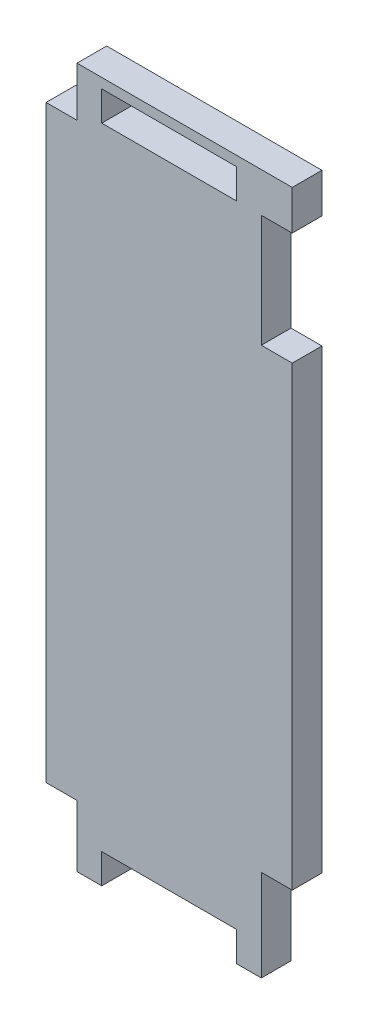
ISO-10303-21;
HEADER;
FILE_DESCRIPTION(('STEP AP214'),'2;1');
FILE_NAME('part.step','',(''),(''),'','','');
FILE_SCHEMA(('AUTOMOTIVE_DESIGN { 1 0 10303 214 1 1 1 1 }'));
ENDSEC;
DATA;
#1=APPLICATION_CONTEXT('core data for automotive mechanical design processes');
#2=APPLICATION_PROTOCOL_DEFINITION('international standard','automotive_design',2000,#1);
#3=PRODUCT_CONTEXT('',#1,'mechanical');
#4=PRODUCT('Part','Part','',(#3));
#5=PRODUCT_RELATED_PRODUCT_CATEGORY('part','',(#4));
#6=PRODUCT_DEFINITION_FORMATION('','',#4);
#7=PRODUCT_DEFINITION_CONTEXT('part definition',#1,'design');
#8=PRODUCT_DEFINITION('design','',#6,#7);
#9=PRODUCT_DEFINITION_SHAPE('','',#8);
#10=(LENGTH_UNIT() NAMED_UNIT(*) SI_UNIT(.MILLI.,.METRE.));
#11=(NAMED_UNIT(*) PLANE_ANGLE_UNIT() SI_UNIT($,.RADIAN.));
#12=(NAMED_UNIT(*) SI_UNIT($,.STERADIAN.) SOLID_ANGLE_UNIT());
#13=UNCERTAINTY_MEASURE_WITH_UNIT(LENGTH_MEASURE(1.E-05),#10,'distance_accuracy_value','');
#14=(GEOMETRIC_REPRESENTATION_CONTEXT(3) GLOBAL_UNCERTAINTY_ASSIGNED_CONTEXT((#13)) GLOBAL_UNIT_ASSIGNED_CONTEXT((#10,
#11,#12)) REPRESENTATION_CONTEXT('',''));
#15=CARTESIAN_POINT('',(0.,0.,0.));
#16=DIRECTION('',(0.,0.,1.));
#17=DIRECTION('',(1.,0.,0.));
#18=AXIS2_PLACEMENT_3D('',#15,#16,#17);
#19=CARTESIAN_POINT('',(-5.71499999999983,0.,3.048));
#20=DIRECTION('',(-1.,0.,0.));
#21=DIRECTION('',(0.,-1.,0.));
#22=AXIS2_PLACEMENT_3D('',#19,#20,#21);
#23=PLANE('',#22);
#24=DIRECTION('',(0.,1.,0.));
#25=VECTOR('',#24,1.);
#26=CARTESIAN_POINT('',(-5.71499999999983,0.,0.));
#27=LINE('',#26,#25);
#28=CARTESIAN_POINT('',(-5.71499999999999,64.77,0.));
#29=VERTEX_POINT('',#28);
#30=CARTESIAN_POINT('',(-5.715,67.818,0.));
#31=VERTEX_POINT('',#30);
#32=EDGE_CURVE('E262',#29,#31,#27,.T.);
#33=ORIENTED_EDGE('',*,*,#32,.F.);
#34=DIRECTION('',(0.,0.,-1.));
#35=VECTOR('',#34,1.);
#36=CARTESIAN_POINT('',(-5.71499999999999,64.77,3.048));
#37=LINE('',#36,#35);
#38=CARTESIAN_POINT('',(-5.71499999999999,64.77,3.048));
#39=VERTEX_POINT('',#38);
#40=EDGE_CURVE('E11',#39,#29,#37,.T.);
#41=ORIENTED_EDGE('',*,*,#40,.F.);
#42=DIRECTION('',(0.,1.,0.));
#43=VECTOR('',#42,1.);
#44=CARTESIAN_POINT('',(-5.71499999999983,0.,3.048));
#45=LINE('',#44,#43);
#46=CARTESIAN_POINT('',(-5.715,67.818,3.048));
#47=VERTEX_POINT('',#46);
#48=EDGE_CURVE('E204',#39,#47,#45,.T.);
#49=ORIENTED_EDGE('',*,*,#48,.T.);
#50=DIRECTION('',(0.,0.,-1.));
#51=VECTOR('',#50,1.);
#52=CARTESIAN_POINT('',(-5.715,67.818,3.048));
#53=LINE('',#52,#51);
#54=EDGE_CURVE('E54',#47,#31,#53,.T.);
#55=ORIENTED_EDGE('',*,*,#54,.T.);
#56=EDGE_LOOP('',(#33,#41,#49,#55));
#57=FACE_BOUND('',#56,.T.);
#58=ADVANCED_FACE('F35',(#57),#23,.T.);
#59=CARTESIAN_POINT('',(0.,64.77,3.048));
#60=DIRECTION('',(0.,-1.,0.));
#61=DIRECTION('',(0.,0.,-1.));
#62=AXIS2_PLACEMENT_3D('',#59,#60,#61);
#63=PLANE('',#62);
#64=DIRECTION('',(-1.,0.,0.));
#65=VECTOR('',#64,1.);
#66=CARTESIAN_POINT('',(0.,64.77,0.));
#67=LINE('',#66,#65);
#68=CARTESIAN_POINT('',(-19.558,64.77,0.));
#69=VERTEX_POINT('',#68);
#70=EDGE_CURVE('E209',#29,#69,#67,.T.);
#71=ORIENTED_EDGE('',*,*,#70,.T.);
#72=DIRECTION('',(0.,0.,-1.));
#73=VECTOR('',#72,1.);
#74=CARTESIAN_POINT('',(-19.558,64.77,3.048));
#75=LINE('',#74,#73);
#76=CARTESIAN_POINT('',(-19.558,64.77,3.048));
#77=VERTEX_POINT('',#76);
#78=EDGE_CURVE('E45',#77,#69,#75,.T.);
#79=ORIENTED_EDGE('',*,*,#78,.F.);
#80=DIRECTION('',(-1.,0.,0.));
#81=VECTOR('',#80,1.);
#82=CARTESIAN_POINT('',(0.,64.77,3.048));
#83=LINE('',#82,#81);
#84=EDGE_CURVE('E199',#39,#77,#83,.T.);
#85=ORIENTED_EDGE('',*,*,#84,.F.);
#86=ORIENTED_EDGE('',*,*,#40,.T.);
#87=EDGE_LOOP('',(#71,#79,#85,#86));
#88=FACE_BOUND('',#87,.T.);
#89=ADVANCED_FACE('F207',(#88),#63,.F.);
#90=CARTESIAN_POINT('',(-19.558,0.,3.048));
#91=DIRECTION('',(-1.,0.,0.));
#92=DIRECTION('',(0.,0.,1.));
#93=AXIS2_PLACEMENT_3D('',#90,#91,#92);
#94=PLANE('',#93);
#95=DIRECTION('',(0.,1.,0.));
#96=VECTOR('',#95,1.);
#97=CARTESIAN_POINT('',(-19.558,0.,0.));
#98=LINE('',#97,#96);
#99=CARTESIAN_POINT('',(-19.558,67.818,0.));
#100=VERTEX_POINT('',#99);
#101=EDGE_CURVE('E259',#69,#100,#98,.T.);
#102=ORIENTED_EDGE('',*,*,#101,.T.);
#103=DIRECTION('',(0.,0.,-1.));
#104=VECTOR('',#103,1.);
#105=CARTESIAN_POINT('',(-19.558,67.818,3.048));
#106=LINE('',#105,#104);
#107=CARTESIAN_POINT('',(-19.558,67.818,3.048));
#108=VERTEX_POINT('',#107);
#109=EDGE_CURVE('E122',#108,#100,#106,.T.);
#110=ORIENTED_EDGE('',*,*,#109,.F.);
#111=DIRECTION('',(0.,1.,0.));
#112=VECTOR('',#111,1.);
#113=CARTESIAN_POINT('',(-19.558,0.,3.048));
#114=LINE('',#113,#112);
#115=EDGE_CURVE('E191',#77,#108,#114,.T.);
#116=ORIENTED_EDGE('',*,*,#115,.F.);
#117=ORIENTED_EDGE('',*,*,#78,.T.);
#118=EDGE_LOOP('',(#102,#110,#116,#117));
#119=FACE_BOUND('',#118,.T.);
#120=ADVANCED_FACE('F193',(#119),#94,.F.);
#121=CARTESIAN_POINT('',(-3.175,0.,3.048));
#122=DIRECTION('',(1.,0.,0.));
#123=DIRECTION('',(0.,0.,-1.));
#124=AXIS2_PLACEMENT_3D('',#121,#122,#123);
#125=PLANE('',#124);
#126=DIRECTION('',(0.,-1.,0.));
#127=VECTOR('',#126,1.);
#128=CARTESIAN_POINT('',(-3.175,0.,0.));
#129=LINE('',#128,#127);
#130=CARTESIAN_POINT('',(-3.175,6.35,0.));
#131=VERTEX_POINT('',#130);
#132=CARTESIAN_POINT('',(-3.175,-3.048,0.));
#133=VERTEX_POINT('',#132);
#134=EDGE_CURVE('E313',#131,#133,#129,.T.);
#135=ORIENTED_EDGE('',*,*,#134,.F.);
#136=DIRECTION('',(0.,0.,-1.));
#137=VECTOR('',#136,1.);
#138=CARTESIAN_POINT('',(-3.175,6.35,3.048));
#139=LINE('',#138,#137);
#140=CARTESIAN_POINT('',(-3.175,6.35,3.048));
#141=VERTEX_POINT('',#140);
#142=EDGE_CURVE('E39',#141,#131,#139,.T.);
#143=ORIENTED_EDGE('',*,*,#142,.F.);
#144=DIRECTION('',(0.,-1.,0.));
#145=VECTOR('',#144,1.);
#146=CARTESIAN_POINT('',(-3.175,0.,3.048));
#147=LINE('',#146,#145);
#148=CARTESIAN_POINT('',(-3.175,-3.048,3.048));
#149=VERTEX_POINT('',#148);
#150=EDGE_CURVE('E258',#141,#149,#147,.T.);
#151=ORIENTED_EDGE('',*,*,#150,.T.);
#152=DIRECTION('',(0.,0.,-1.));
#153=VECTOR('',#152,1.);
#154=CARTESIAN_POINT('',(-3.175,-3.048,3.048));
#155=LINE('',#154,#153);
#156=EDGE_CURVE('E214',#149,#133,#155,.T.);
#157=ORIENTED_EDGE('',*,*,#156,.T.);
#158=EDGE_LOOP('',(#135,#143,#151,#157));
#159=FACE_BOUND('',#158,.T.);
#160=ADVANCED_FACE('F37',(#159),#125,.T.);
#161=CARTESIAN_POINT('',(0.,6.35,3.048));
#162=DIRECTION('',(0.,1.,0.));
#163=DIRECTION('',(0.,0.,1.));
#164=AXIS2_PLACEMENT_3D('',#161,#162,#163);
#165=PLANE('',#164);
#166=DIRECTION('',(1.,0.,0.));
#167=VECTOR('',#166,1.);
#168=CARTESIAN_POINT('',(0.,6.35,0.));
#169=LINE('',#168,#167);
#170=CARTESIAN_POINT('',(0.,6.35,0.));
#171=VERTEX_POINT('',#170);
#172=EDGE_CURVE('E311',#131,#171,#169,.T.);
#173=ORIENTED_EDGE('',*,*,#172,.T.);
#174=DIRECTION('',(0.,0.,-1.));
#175=VECTOR('',#174,1.);
#176=CARTESIAN_POINT('',(0.,6.35,3.048));
#177=LINE('',#176,#175);
#178=CARTESIAN_POINT('',(0.,6.35,3.048));
#179=VERTEX_POINT('',#178);
#180=EDGE_CURVE('E246',#179,#171,#177,.T.);
#181=ORIENTED_EDGE('',*,*,#180,.F.);
#182=DIRECTION('',(1.,0.,0.));
#183=VECTOR('',#182,1.);
#184=CARTESIAN_POINT('',(0.,6.35,3.048));
#185=LINE('',#184,#183);
#186=EDGE_CURVE('E363',#141,#179,#185,.T.);
#187=ORIENTED_EDGE('',*,*,#186,.F.);
#188=ORIENTED_EDGE('',*,*,#142,.T.);
#189=EDGE_LOOP('',(#173,#181,#187,#188));
#190=FACE_BOUND('',#189,.T.);
#191=ADVANCED_FACE('F377',(#190),#165,.F.);
#192=CARTESIAN_POINT('',(0.,0.,3.048));
#193=DIRECTION('',(1.,0.,0.));
#194=DIRECTION('',(0.,0.,-1.));
#195=AXIS2_PLACEMENT_3D('',#192,#193,#194);
#196=PLANE('',#195);
#197=DIRECTION('',(0.,-1.,0.));
#198=VECTOR('',#197,1.);
#199=CARTESIAN_POINT('',(0.,0.,0.));
#200=LINE('',#199,#198);
#201=CARTESIAN_POINT('',(0.,53.213,0.));
#202=VERTEX_POINT('',#201);
#203=EDGE_CURVE('E308',#202,#171,#200,.T.);
#204=ORIENTED_EDGE('',*,*,#203,.F.);
#205=DIRECTION('',(0.,0.,-1.));
#206=VECTOR('',#205,1.);
#207=CARTESIAN_POINT('',(0.,53.213,3.048));
#208=LINE('',#207,#206);
#209=CARTESIAN_POINT('',(0.,53.213,3.048));
#210=VERTEX_POINT('',#209);
#211=EDGE_CURVE('E245',#210,#202,#208,.T.);
#212=ORIENTED_EDGE('',*,*,#211,.F.);
#213=DIRECTION('',(0.,-1.,0.));
#214=VECTOR('',#213,1.);
#215=CARTESIAN_POINT('',(0.,0.,3.048));
#216=LINE('',#215,#214);
#217=EDGE_CURVE('E361',#210,#179,#216,.T.);
#218=ORIENTED_EDGE('',*,*,#217,.T.);
#219=ORIENTED_EDGE('',*,*,#180,.T.);
#220=EDGE_LOOP('',(#204,#212,#218,#219));
#221=FACE_BOUND('',#220,.T.);
#222=ADVANCED_FACE('F379',(#221),#196,.T.);
#223=CARTESIAN_POINT('',(0.,53.213,3.048));
#224=DIRECTION('',(0.,1.,0.));
#225=DIRECTION('',(0.,0.,1.));
#226=AXIS2_PLACEMENT_3D('',#223,#224,#225);
#227=PLANE('',#226);
#228=DIRECTION('',(1.,0.,0.));
#229=VECTOR('',#228,1.);
#230=CARTESIAN_POINT('',(0.,53.213,0.));
#231=LINE('',#230,#229);
#232=CARTESIAN_POINT('',(-3.175,53.213,0.));
#233=VERTEX_POINT('',#232);
#234=EDGE_CURVE('E305',#233,#202,#231,.T.);
#235=ORIENTED_EDGE('',*,*,#234,.F.);
#236=DIRECTION('',(0.,0.,-1.));
#237=VECTOR('',#236,1.);
#238=CARTESIAN_POINT('',(-3.175,53.213,3.048));
#239=LINE('',#238,#237);
#240=CARTESIAN_POINT('',(-3.175,53.213,3.048));
#241=VERTEX_POINT('',#240);
#242=EDGE_CURVE('E243',#241,#233,#239,.T.);
#243=ORIENTED_EDGE('',*,*,#242,.F.);
#244=DIRECTION('',(1.,0.,0.));
#245=VECTOR('',#244,1.);
#246=CARTESIAN_POINT('',(0.,53.213,3.048));
#247=LINE('',#246,#245);
#248=EDGE_CURVE('E358',#241,#210,#247,.T.);
#249=ORIENTED_EDGE('',*,*,#248,.T.);
#250=ORIENTED_EDGE('',*,*,#211,.T.);
#251=EDGE_LOOP('',(#235,#243,#249,#250));
#252=FACE_BOUND('',#251,.T.);
#253=ADVANCED_FACE('F384',(#252),#227,.T.);
#254=CARTESIAN_POINT('',(-3.17500000000003,0.,3.048));
#255=DIRECTION('',(1.,0.,0.));
#256=DIRECTION('',(0.,1.,0.));
#257=AXIS2_PLACEMENT_3D('',#254,#255,#256);
#258=PLANE('',#257);
#259=DIRECTION('',(0.,-1.,0.));
#260=VECTOR('',#259,1.);
#261=CARTESIAN_POINT('',(-3.17500000000003,0.,0.));
#262=LINE('',#261,#260);
#263=CARTESIAN_POINT('',(-3.17499999999999,64.77,0.));
#264=VERTEX_POINT('',#263);
#265=EDGE_CURVE('E302',#264,#233,#262,.T.);
#266=ORIENTED_EDGE('',*,*,#265,.F.);
#267=DIRECTION('',(0.,0.,-1.));
#268=VECTOR('',#267,1.);
#269=CARTESIAN_POINT('',(-3.17499999999999,64.77,3.048));
#270=LINE('',#269,#268);
#271=CARTESIAN_POINT('',(-3.17499999999999,64.77,3.048));
#272=VERTEX_POINT('',#271);
#273=EDGE_CURVE('E241',#272,#264,#270,.T.);
#274=ORIENTED_EDGE('',*,*,#273,.F.);
#275=DIRECTION('',(0.,-1.,0.));
#276=VECTOR('',#275,1.);
#277=CARTESIAN_POINT('',(-3.17500000000003,0.,3.048));
#278=LINE('',#277,#276);
#279=EDGE_CURVE('E355',#272,#241,#278,.T.);
#280=ORIENTED_EDGE('',*,*,#279,.T.);
#281=ORIENTED_EDGE('',*,*,#242,.T.);
#282=EDGE_LOOP('',(#266,#274,#280,#281));
#283=FACE_BOUND('',#282,.T.);
#284=ADVANCED_FACE('F387',(#283),#258,.T.);
#285=CARTESIAN_POINT('',(0.,64.77,3.048));
#286=DIRECTION('',(0.,-1.,0.));
#287=DIRECTION('',(0.,0.,-1.));
#288=AXIS2_PLACEMENT_3D('',#285,#286,#287);
#289=PLANE('',#288);
#290=DIRECTION('',(-1.,0.,0.));
#291=VECTOR('',#290,1.);
#292=CARTESIAN_POINT('',(0.,64.77,0.));
#293=LINE('',#292,#291);
#294=CARTESIAN_POINT('',(0.,64.77,0.));
#295=VERTEX_POINT('',#294);
#296=EDGE_CURVE('E299',#295,#264,#293,.T.);
#297=ORIENTED_EDGE('',*,*,#296,.F.);
#298=DIRECTION('',(0.,0.,-1.));
#299=VECTOR('',#298,1.);
#300=CARTESIAN_POINT('',(0.,64.77,3.048));
#301=LINE('',#300,#299);
#302=CARTESIAN_POINT('',(0.,64.77,3.048));
#303=VERTEX_POINT('',#302);
#304=EDGE_CURVE('E239',#303,#295,#301,.T.);
#305=ORIENTED_EDGE('',*,*,#304,.F.);
#306=DIRECTION('',(-1.,0.,0.));
#307=VECTOR('',#306,1.);
#308=CARTESIAN_POINT('',(0.,64.77,3.048));
#309=LINE('',#308,#307);
#310=EDGE_CURVE('E352',#303,#272,#309,.T.);
#311=ORIENTED_EDGE('',*,*,#310,.T.);
#312=ORIENTED_EDGE('',*,*,#273,.T.);
#313=EDGE_LOOP('',(#297,#305,#311,#312));
#314=FACE_BOUND('',#313,.T.);
#315=ADVANCED_FACE('F392',(#314),#289,.T.);
#316=CARTESIAN_POINT('',(0.,0.,3.048));
#317=DIRECTION('',(1.,0.,0.));
#318=DIRECTION('',(0.,1.,0.));
#319=AXIS2_PLACEMENT_3D('',#316,#317,#318);
#320=PLANE('',#319);
#321=DIRECTION('',(0.,-1.,0.));
#322=VECTOR('',#321,1.);
#323=CARTESIAN_POINT('',(0.,0.,0.));
#324=LINE('',#323,#322);
#325=CARTESIAN_POINT('',(0.,68.834,0.));
#326=VERTEX_POINT('',#325);
#327=EDGE_CURVE('E296',#326,#295,#324,.T.);
#328=ORIENTED_EDGE('',*,*,#327,.F.);
#329=DIRECTION('',(0.,0.,-1.));
#330=VECTOR('',#329,1.);
#331=CARTESIAN_POINT('',(0.,68.834,3.048));
#332=LINE('',#331,#330);
#333=CARTESIAN_POINT('',(0.,68.834,3.048));
#334=VERTEX_POINT('',#333);
#335=EDGE_CURVE('E237',#334,#326,#332,.T.);
#336=ORIENTED_EDGE('',*,*,#335,.F.);
#337=DIRECTION('',(0.,-1.,0.));
#338=VECTOR('',#337,1.);
#339=CARTESIAN_POINT('',(0.,0.,3.048));
#340=LINE('',#339,#338);
#341=EDGE_CURVE('E349',#334,#303,#340,.T.);
#342=ORIENTED_EDGE('',*,*,#341,.T.);
#343=ORIENTED_EDGE('',*,*,#304,.T.);
#344=EDGE_LOOP('',(#328,#336,#342,#343));
#345=FACE_BOUND('',#344,.T.);
#346=ADVANCED_FACE('F395',(#345),#320,.T.);
#347=CARTESIAN_POINT('',(0.,68.834,3.048));
#348=DIRECTION('',(0.,1.,0.));
#349=DIRECTION('',(0.,0.,1.));
#350=AXIS2_PLACEMENT_3D('',#347,#348,#349);
#351=PLANE('',#350);
#352=DIRECTION('',(1.,0.,0.));
#353=VECTOR('',#352,1.);
#354=CARTESIAN_POINT('',(0.,68.834,0.));
#355=LINE('',#354,#353);
#356=CARTESIAN_POINT('',(-22.098,68.834,0.));
#357=VERTEX_POINT('',#356);
#358=EDGE_CURVE('E293',#357,#326,#355,.T.);
#359=ORIENTED_EDGE('',*,*,#358,.F.);
#360=DIRECTION('',(0.,0.,-1.));
#361=VECTOR('',#360,1.);
#362=CARTESIAN_POINT('',(-22.098,68.834,3.048));
#363=LINE('',#362,#361);
#364=CARTESIAN_POINT('',(-22.098,68.834,3.048));
#365=VERTEX_POINT('',#364);
#366=EDGE_CURVE('E235',#365,#357,#363,.T.);
#367=ORIENTED_EDGE('',*,*,#366,.F.);
#368=DIRECTION('',(1.,0.,0.));
#369=VECTOR('',#368,1.);
#370=CARTESIAN_POINT('',(0.,68.834,3.048));
#371=LINE('',#370,#369);
#372=EDGE_CURVE('E346',#365,#334,#371,.T.);
#373=ORIENTED_EDGE('',*,*,#372,.T.);
#374=ORIENTED_EDGE('',*,*,#335,.T.);
#375=EDGE_LOOP('',(#359,#367,#373,#374));
#376=FACE_BOUND('',#375,.T.);
#377=ADVANCED_FACE('F400',(#376),#351,.T.);
#378=CARTESIAN_POINT('',(-22.098,0.,3.048));
#379=DIRECTION('',(-1.,0.,0.));
#380=DIRECTION('',(0.,0.,1.));
#381=AXIS2_PLACEMENT_3D('',#378,#379,#380);
#382=PLANE('',#381);
#383=DIRECTION('',(0.,1.,0.));
#384=VECTOR('',#383,1.);
#385=CARTESIAN_POINT('',(-22.098,0.,0.));
#386=LINE('',#385,#384);
#387=CARTESIAN_POINT('',(-22.098,63.754,0.));
#388=VERTEX_POINT('',#387);
#389=EDGE_CURVE('E290',#388,#357,#386,.T.);
#390=ORIENTED_EDGE('',*,*,#389,.F.);
#391=DIRECTION('',(0.,0.,-1.));
#392=VECTOR('',#391,1.);
#393=CARTESIAN_POINT('',(-22.098,63.754,3.048));
#394=LINE('',#393,#392);
#395=CARTESIAN_POINT('',(-22.098,63.754,3.048));
#396=VERTEX_POINT('',#395);
#397=EDGE_CURVE('E233',#396,#388,#394,.T.);
#398=ORIENTED_EDGE('',*,*,#397,.F.);
#399=DIRECTION('',(0.,1.,0.));
#400=VECTOR('',#399,1.);
#401=CARTESIAN_POINT('',(-22.098,0.,3.048));
#402=LINE('',#401,#400);
#403=EDGE_CURVE('E343',#396,#365,#402,.T.);
#404=ORIENTED_EDGE('',*,*,#403,.T.);
#405=ORIENTED_EDGE('',*,*,#366,.T.);
#406=EDGE_LOOP('',(#390,#398,#404,#405));
#407=FACE_BOUND('',#406,.T.);
#408=ADVANCED_FACE('F403',(#407),#382,.T.);
#409=CARTESIAN_POINT('',(0.,63.754,3.048));
#410=DIRECTION('',(0.,-1.,0.));
#411=DIRECTION('',(0.,0.,-1.));
#412=AXIS2_PLACEMENT_3D('',#409,#410,#411);
#413=PLANE('',#412);
#414=DIRECTION('',(-1.,0.,0.));
#415=VECTOR('',#414,1.);
#416=CARTESIAN_POINT('',(0.,63.754,0.));
#417=LINE('',#416,#415);
#418=CARTESIAN_POINT('',(-25.273,63.754,0.));
#419=VERTEX_POINT('',#418);
#420=EDGE_CURVE('E288',#388,#419,#417,.T.);
#421=ORIENTED_EDGE('',*,*,#420,.T.);
#422=DIRECTION('',(0.,0.,-1.));
#423=VECTOR('',#422,1.);
#424=CARTESIAN_POINT('',(-25.273,63.754,3.048));
#425=LINE('',#424,#423);
#426=CARTESIAN_POINT('',(-25.273,63.754,3.048));
#427=VERTEX_POINT('',#426);
#428=EDGE_CURVE('E230',#427,#419,#425,.T.);
#429=ORIENTED_EDGE('',*,*,#428,.F.);
#430=DIRECTION('',(-1.,0.,0.));
#431=VECTOR('',#430,1.);
#432=CARTESIAN_POINT('',(0.,63.754,3.048));
#433=LINE('',#432,#431);
#434=EDGE_CURVE('E341',#396,#427,#433,.T.);
#435=ORIENTED_EDGE('',*,*,#434,.F.);
#436=ORIENTED_EDGE('',*,*,#397,.T.);
#437=EDGE_LOOP('',(#421,#429,#435,#436));
#438=FACE_BOUND('',#437,.T.);
#439=ADVANCED_FACE('F410',(#438),#413,.F.);
#440=CARTESIAN_POINT('',(-25.273,0.,3.048));
#441=DIRECTION('',(1.,0.,0.));
#442=DIRECTION('',(0.,0.,-1.));
#443=AXIS2_PLACEMENT_3D('',#440,#441,#442);
#444=PLANE('',#443);
#445=DIRECTION('',(0.,-1.,0.));
#446=VECTOR('',#445,1.);
#447=CARTESIAN_POINT('',(-25.273,0.,0.));
#448=LINE('',#447,#446);
#449=CARTESIAN_POINT('',(-25.273,3.27660000000002,0.));
#450=VERTEX_POINT('',#449);
#451=EDGE_CURVE('E285',#419,#450,#448,.T.);
#452=ORIENTED_EDGE('',*,*,#451,.T.);
#453=DIRECTION('',(0.,0.,-1.));
#454=VECTOR('',#453,1.);
#455=CARTESIAN_POINT('',(-25.273,3.27660000000002,3.048));
#456=LINE('',#455,#454);
#457=CARTESIAN_POINT('',(-25.273,3.27660000000002,3.048));
#458=VERTEX_POINT('',#457);
#459=EDGE_CURVE('E228',#458,#450,#456,.T.);
#460=ORIENTED_EDGE('',*,*,#459,.F.);
#461=DIRECTION('',(0.,-1.,0.));
#462=VECTOR('',#461,1.);
#463=CARTESIAN_POINT('',(-25.273,0.,3.048));
#464=LINE('',#463,#462);
#465=EDGE_CURVE('E339',#427,#458,#464,.T.);
#466=ORIENTED_EDGE('',*,*,#465,.F.);
#467=ORIENTED_EDGE('',*,*,#428,.T.);
#468=EDGE_LOOP('',(#452,#460,#466,#467));
#469=FACE_BOUND('',#468,.T.);
#470=ADVANCED_FACE('F414',(#469),#444,.F.);
#471=CARTESIAN_POINT('',(0.,3.27660000000001,3.048));
#472=DIRECTION('',(0.,-1.,0.));
#473=DIRECTION('',(1.,0.,0.));
#474=AXIS2_PLACEMENT_3D('',#471,#472,#473);
#475=PLANE('',#474);
#476=DIRECTION('',(-1.,0.,0.));
#477=VECTOR('',#476,1.);
#478=CARTESIAN_POINT('',(0.,3.27660000000001,0.));
#479=LINE('',#478,#477);
#480=CARTESIAN_POINT('',(-22.098,3.27660000000002,0.));
#481=VERTEX_POINT('',#480);
#482=EDGE_CURVE('E282',#481,#450,#479,.T.);
#483=ORIENTED_EDGE('',*,*,#482,.F.);
#484=DIRECTION('',(0.,0.,-1.));
#485=VECTOR('',#484,1.);
#486=CARTESIAN_POINT('',(-22.098,3.27660000000002,3.048));
#487=LINE('',#486,#485);
#488=CARTESIAN_POINT('',(-22.098,3.27660000000002,3.048));
#489=VERTEX_POINT('',#488);
#490=EDGE_CURVE('E226',#489,#481,#487,.T.);
#491=ORIENTED_EDGE('',*,*,#490,.F.);
#492=DIRECTION('',(-1.,0.,0.));
#493=VECTOR('',#492,1.);
#494=CARTESIAN_POINT('',(0.,3.27660000000001,3.048));
#495=LINE('',#494,#493);
#496=EDGE_CURVE('E336',#489,#458,#495,.T.);
#497=ORIENTED_EDGE('',*,*,#496,.T.);
#498=ORIENTED_EDGE('',*,*,#459,.T.);
#499=EDGE_LOOP('',(#483,#491,#497,#498));
#500=FACE_BOUND('',#499,.T.);
#501=ADVANCED_FACE('F417',(#500),#475,.T.);
#502=CARTESIAN_POINT('',(-22.098,0.,3.048));
#503=DIRECTION('',(-1.,0.,0.));
#504=DIRECTION('',(0.,0.,1.));
#505=AXIS2_PLACEMENT_3D('',#502,#503,#504);
#506=PLANE('',#505);
#507=DIRECTION('',(0.,1.,0.));
#508=VECTOR('',#507,1.);
#509=CARTESIAN_POINT('',(-22.098,0.,0.));
#510=LINE('',#509,#508);
#511=CARTESIAN_POINT('',(-22.098,-3.048,0.));
#512=VERTEX_POINT('',#511);
#513=EDGE_CURVE('E279',#512,#481,#510,.T.);
#514=ORIENTED_EDGE('',*,*,#513,.F.);
#515=DIRECTION('',(0.,0.,-1.));
#516=VECTOR('',#515,1.);
#517=CARTESIAN_POINT('',(-22.098,-3.048,3.048));
#518=LINE('',#517,#516);
#519=CARTESIAN_POINT('',(-22.098,-3.048,3.048));
#520=VERTEX_POINT('',#519);
#521=EDGE_CURVE('E224',#520,#512,#518,.T.);
#522=ORIENTED_EDGE('',*,*,#521,.F.);
#523=DIRECTION('',(0.,1.,0.));
#524=VECTOR('',#523,1.);
#525=CARTESIAN_POINT('',(-22.098,0.,3.048));
#526=LINE('',#525,#524);
#527=EDGE_CURVE('E333',#520,#489,#526,.T.);
#528=ORIENTED_EDGE('',*,*,#527,.T.);
#529=ORIENTED_EDGE('',*,*,#490,.T.);
#530=EDGE_LOOP('',(#514,#522,#528,#529));
#531=FACE_BOUND('',#530,.T.);
#532=ADVANCED_FACE('F422',(#531),#506,.T.);
#533=CARTESIAN_POINT('',(0.,-3.048,3.048));
#534=DIRECTION('',(0.,-1.,0.));
#535=DIRECTION('',(0.,0.,-1.));
#536=AXIS2_PLACEMENT_3D('',#533,#534,#535);
#537=PLANE('',#536);
#538=DIRECTION('',(-1.,0.,0.));
#539=VECTOR('',#538,1.);
#540=CARTESIAN_POINT('',(0.,-3.048,0.));
#541=LINE('',#540,#539);
#542=CARTESIAN_POINT('',(-19.558,-3.048,0.));
#543=VERTEX_POINT('',#542);
#544=EDGE_CURVE('E276',#543,#512,#541,.T.);
#545=ORIENTED_EDGE('',*,*,#544,.F.);
#546=DIRECTION('',(0.,0.,-1.));
#547=VECTOR('',#546,1.);
#548=CARTESIAN_POINT('',(-19.558,-3.048,3.048));
#549=LINE('',#548,#547);
#550=CARTESIAN_POINT('',(-19.558,-3.048,3.048));
#551=VERTEX_POINT('',#550);
#552=EDGE_CURVE('E222',#551,#543,#549,.T.);
#553=ORIENTED_EDGE('',*,*,#552,.F.);
#554=DIRECTION('',(-1.,0.,0.));
#555=VECTOR('',#554,1.);
#556=CARTESIAN_POINT('',(0.,-3.048,3.048));
#557=LINE('',#556,#555);
#558=EDGE_CURVE('E330',#551,#520,#557,.T.);
#559=ORIENTED_EDGE('',*,*,#558,.T.);
#560=ORIENTED_EDGE('',*,*,#521,.T.);
#561=EDGE_LOOP('',(#545,#553,#559,#560));
#562=FACE_BOUND('',#561,.T.);
#563=ADVANCED_FACE('F425',(#562),#537,.T.);
#564=CARTESIAN_POINT('',(-19.558,0.,3.048));
#565=DIRECTION('',(1.,0.,0.));
#566=DIRECTION('',(0.,0.,-1.));
#567=AXIS2_PLACEMENT_3D('',#564,#565,#566);
#568=PLANE('',#567);
#569=DIRECTION('',(0.,-1.,0.));
#570=VECTOR('',#569,1.);
#571=CARTESIAN_POINT('',(-19.558,0.,0.));
#572=LINE('',#571,#570);
#573=CARTESIAN_POINT('',(-19.558,0.,0.));
#574=VERTEX_POINT('',#573);
#575=EDGE_CURVE('E273',#574,#543,#572,.T.);
#576=ORIENTED_EDGE('',*,*,#575,.F.);
#577=DIRECTION('',(0.,0.,-1.));
#578=VECTOR('',#577,1.);
#579=CARTESIAN_POINT('',(-19.558,0.,3.048));
#580=LINE('',#579,#578);
#581=CARTESIAN_POINT('',(-19.558,0.,3.048));
#582=VERTEX_POINT('',#581);
#583=EDGE_CURVE('E220',#582,#574,#580,.T.);
#584=ORIENTED_EDGE('',*,*,#583,.F.);
#585=DIRECTION('',(0.,-1.,0.));
#586=VECTOR('',#585,1.);
#587=CARTESIAN_POINT('',(-19.558,0.,3.048));
#588=LINE('',#587,#586);
#589=EDGE_CURVE('E327',#582,#551,#588,.T.);
#590=ORIENTED_EDGE('',*,*,#589,.T.);
#591=ORIENTED_EDGE('',*,*,#552,.T.);
#592=EDGE_LOOP('',(#576,#584,#590,#591));
#593=FACE_BOUND('',#592,.T.);
#594=ADVANCED_FACE('F429',(#593),#568,.T.);
#595=CARTESIAN_POINT('',(0.,0.,3.048));
#596=DIRECTION('',(0.,-1.,0.));
#597=DIRECTION('',(0.,0.,-1.));
#598=AXIS2_PLACEMENT_3D('',#595,#596,#597);
#599=PLANE('',#598);
#600=DIRECTION('',(-1.,0.,0.));
#601=VECTOR('',#600,1.);
#602=CARTESIAN_POINT('',(0.,0.,0.));
#603=LINE('',#602,#601);
#604=CARTESIAN_POINT('',(-5.715,0.,0.));
#605=VERTEX_POINT('',#604);
#606=EDGE_CURVE('E270',#605,#574,#603,.T.);
#607=ORIENTED_EDGE('',*,*,#606,.F.);
#608=DIRECTION('',(0.,0.,-1.));
#609=VECTOR('',#608,1.);
#610=CARTESIAN_POINT('',(-5.715,0.,3.048));
#611=LINE('',#610,#609);
#612=CARTESIAN_POINT('',(-5.715,0.,3.048));
#613=VERTEX_POINT('',#612);
#614=EDGE_CURVE('E218',#613,#605,#611,.T.);
#615=ORIENTED_EDGE('',*,*,#614,.F.);
#616=DIRECTION('',(-1.,0.,0.));
#617=VECTOR('',#616,1.);
#618=CARTESIAN_POINT('',(0.,0.,3.048));
#619=LINE('',#618,#617);
#620=EDGE_CURVE('E324',#613,#582,#619,.T.);
#621=ORIENTED_EDGE('',*,*,#620,.T.);
#622=ORIENTED_EDGE('',*,*,#583,.T.);
#623=EDGE_LOOP('',(#607,#615,#621,#622));
#624=FACE_BOUND('',#623,.T.);
#625=ADVANCED_FACE('F432',(#624),#599,.T.);
#626=CARTESIAN_POINT('',(-5.715,0.,3.048));
#627=DIRECTION('',(-1.,0.,0.));
#628=DIRECTION('',(0.,0.,1.));
#629=AXIS2_PLACEMENT_3D('',#626,#627,#628);
#630=PLANE('',#629);
#631=DIRECTION('',(0.,1.,0.));
#632=VECTOR('',#631,1.);
#633=CARTESIAN_POINT('',(-5.715,0.,0.));
#634=LINE('',#633,#632);
#635=CARTESIAN_POINT('',(-5.715,-3.048,0.));
#636=VERTEX_POINT('',#635);
#637=EDGE_CURVE('E267',#636,#605,#634,.T.);
#638=ORIENTED_EDGE('',*,*,#637,.F.);
#639=DIRECTION('',(0.,0.,-1.));
#640=VECTOR('',#639,1.);
#641=CARTESIAN_POINT('',(-5.715,-3.048,3.048));
#642=LINE('',#641,#640);
#643=CARTESIAN_POINT('',(-5.715,-3.048,3.048));
#644=VERTEX_POINT('',#643);
#645=EDGE_CURVE('E216',#644,#636,#642,.T.);
#646=ORIENTED_EDGE('',*,*,#645,.F.);
#647=DIRECTION('',(0.,1.,0.));
#648=VECTOR('',#647,1.);
#649=CARTESIAN_POINT('',(-5.715,0.,3.048));
#650=LINE('',#649,#648);
#651=EDGE_CURVE('E321',#644,#613,#650,.T.);
#652=ORIENTED_EDGE('',*,*,#651,.T.);
#653=ORIENTED_EDGE('',*,*,#614,.T.);
#654=EDGE_LOOP('',(#638,#646,#652,#653));
#655=FACE_BOUND('',#654,.T.);
#656=ADVANCED_FACE('F434',(#655),#630,.T.);
#657=CARTESIAN_POINT('',(0.,-3.048,3.048));
#658=DIRECTION('',(0.,-1.,0.));
#659=DIRECTION('',(1.,0.,0.));
#660=AXIS2_PLACEMENT_3D('',#657,#658,#659);
#661=PLANE('',#660);
#662=DIRECTION('',(-1.,0.,0.));
#663=VECTOR('',#662,1.);
#664=CARTESIAN_POINT('',(0.,-3.048,0.));
#665=LINE('',#664,#663);
#666=EDGE_CURVE('E264',#133,#636,#665,.T.);
#667=ORIENTED_EDGE('',*,*,#666,.F.);
#668=ORIENTED_EDGE('',*,*,#156,.F.);
#669=DIRECTION('',(-1.,0.,0.));
#670=VECTOR('',#669,1.);
#671=CARTESIAN_POINT('',(0.,-3.048,3.048));
#672=LINE('',#671,#670);
#673=EDGE_CURVE('E318',#149,#644,#672,.T.);
#674=ORIENTED_EDGE('',*,*,#673,.T.);
#675=ORIENTED_EDGE('',*,*,#645,.T.);
#676=EDGE_LOOP('',(#667,#668,#674,#675));
#677=FACE_BOUND('',#676,.T.);
#678=ADVANCED_FACE('F372',(#677),#661,.T.);
#679=CARTESIAN_POINT('',(0.,67.818,3.048));
#680=DIRECTION('',(0.,-1.,0.));
#681=DIRECTION('',(0.,0.,-1.));
#682=AXIS2_PLACEMENT_3D('',#679,#680,#681);
#683=PLANE('',#682);
#684=DIRECTION('',(-1.,0.,0.));
#685=VECTOR('',#684,1.);
#686=CARTESIAN_POINT('',(0.,67.818,0.));
#687=LINE('',#686,#685);
#688=EDGE_CURVE('E255',#31,#100,#687,.T.);
#689=ORIENTED_EDGE('',*,*,#688,.F.);
#690=ORIENTED_EDGE('',*,*,#54,.F.);
#691=DIRECTION('',(-1.,0.,0.));
#692=VECTOR('',#691,1.);
#693=CARTESIAN_POINT('',(0.,67.818,3.048));
#694=LINE('',#693,#692);
#695=EDGE_CURVE('E198',#47,#108,#694,.T.);
#696=ORIENTED_EDGE('',*,*,#695,.T.);
#697=ORIENTED_EDGE('',*,*,#109,.T.);
#698=EDGE_LOOP('',(#689,#690,#696,#697));
#699=FACE_BOUND('',#698,.T.);
#700=ADVANCED_FACE('F441',(#699),#683,.T.);
#701=CARTESIAN_POINT('',(0.,0.,3.048));
#702=DIRECTION('',(0.,0.,1.));
#703=DIRECTION('',(1.,0.,0.));
#704=AXIS2_PLACEMENT_3D('',#701,#702,#703);
#705=PLANE('',#704);
#706=ORIENTED_EDGE('',*,*,#150,.F.);
#707=ORIENTED_EDGE('',*,*,#186,.T.);
#708=ORIENTED_EDGE('',*,*,#217,.F.);
#709=ORIENTED_EDGE('',*,*,#248,.F.);
#710=ORIENTED_EDGE('',*,*,#279,.F.);
#711=ORIENTED_EDGE('',*,*,#310,.F.);
#712=ORIENTED_EDGE('',*,*,#341,.F.);
#713=ORIENTED_EDGE('',*,*,#372,.F.);
#714=ORIENTED_EDGE('',*,*,#403,.F.);
#715=ORIENTED_EDGE('',*,*,#434,.T.);
#716=ORIENTED_EDGE('',*,*,#465,.T.);
#717=ORIENTED_EDGE('',*,*,#496,.F.);
#718=ORIENTED_EDGE('',*,*,#527,.F.);
#719=ORIENTED_EDGE('',*,*,#558,.F.);
#720=ORIENTED_EDGE('',*,*,#589,.F.);
#721=ORIENTED_EDGE('',*,*,#620,.F.);
#722=ORIENTED_EDGE('',*,*,#651,.F.);
#723=ORIENTED_EDGE('',*,*,#673,.F.);
#724=EDGE_LOOP('',(#706,#707,#708,#709,#710,#711,#712,#713,#714,#715,#716,#717,#718,#719,#720,
#721,#722,#723));
#725=FACE_BOUND('',#724,.T.);
#726=ORIENTED_EDGE('',*,*,#48,.F.);
#727=ORIENTED_EDGE('',*,*,#84,.T.);
#728=ORIENTED_EDGE('',*,*,#115,.T.);
#729=ORIENTED_EDGE('',*,*,#695,.F.);
#730=EDGE_LOOP('',(#726,#727,#728,#729));
#731=FACE_BOUND('',#730,.T.);
#732=ADVANCED_FACE('F203',(#725,#731),#705,.T.);
#733=CARTESIAN_POINT('',(0.,0.,0.));
#734=DIRECTION('',(0.,0.,1.));
#735=DIRECTION('',(1.,0.,0.));
#736=AXIS2_PLACEMENT_3D('',#733,#734,#735);
#737=PLANE('',#736);
#738=ORIENTED_EDGE('',*,*,#134,.T.);
#739=ORIENTED_EDGE('',*,*,#666,.T.);
#740=ORIENTED_EDGE('',*,*,#637,.T.);
#741=ORIENTED_EDGE('',*,*,#606,.T.);
#742=ORIENTED_EDGE('',*,*,#575,.T.);
#743=ORIENTED_EDGE('',*,*,#544,.T.);
#744=ORIENTED_EDGE('',*,*,#513,.T.);
#745=ORIENTED_EDGE('',*,*,#482,.T.);
#746=ORIENTED_EDGE('',*,*,#451,.F.);
#747=ORIENTED_EDGE('',*,*,#420,.F.);
#748=ORIENTED_EDGE('',*,*,#389,.T.);
#749=ORIENTED_EDGE('',*,*,#358,.T.);
#750=ORIENTED_EDGE('',*,*,#327,.T.);
#751=ORIENTED_EDGE('',*,*,#296,.T.);
#752=ORIENTED_EDGE('',*,*,#265,.T.);
#753=ORIENTED_EDGE('',*,*,#234,.T.);
#754=ORIENTED_EDGE('',*,*,#203,.T.);
#755=ORIENTED_EDGE('',*,*,#172,.F.);
#756=EDGE_LOOP('',(#738,#739,#740,#741,#742,#743,#744,#745,#746,#747,#748,#749,#750,#751,#752,
#753,#754,#755));
#757=FACE_BOUND('',#756,.T.);
#758=ORIENTED_EDGE('',*,*,#32,.T.);
#759=ORIENTED_EDGE('',*,*,#688,.T.);
#760=ORIENTED_EDGE('',*,*,#101,.F.);
#761=ORIENTED_EDGE('',*,*,#70,.F.);
#762=EDGE_LOOP('',(#758,#759,#760,#761));
#763=FACE_BOUND('',#762,.T.);
#764=ADVANCED_FACE('F375',(#757,#763),#737,.F.);
#765=CLOSED_SHELL('',(#58,#89,#120,#160,#191,#222,#253,#284,#315,#346,#377,#408,#439,#470,#501,
#532,#563,#594,#625,#656,#678,#700,#732,#764));
#766=MANIFOLD_SOLID_BREP('B2',#765);
#767=ADVANCED_BREP_SHAPE_REPRESENTATION('',(#18,#766),#14);
#768=SHAPE_DEFINITION_REPRESENTATION(#9,#767);
ENDSEC;
END-ISO-10303-21;
